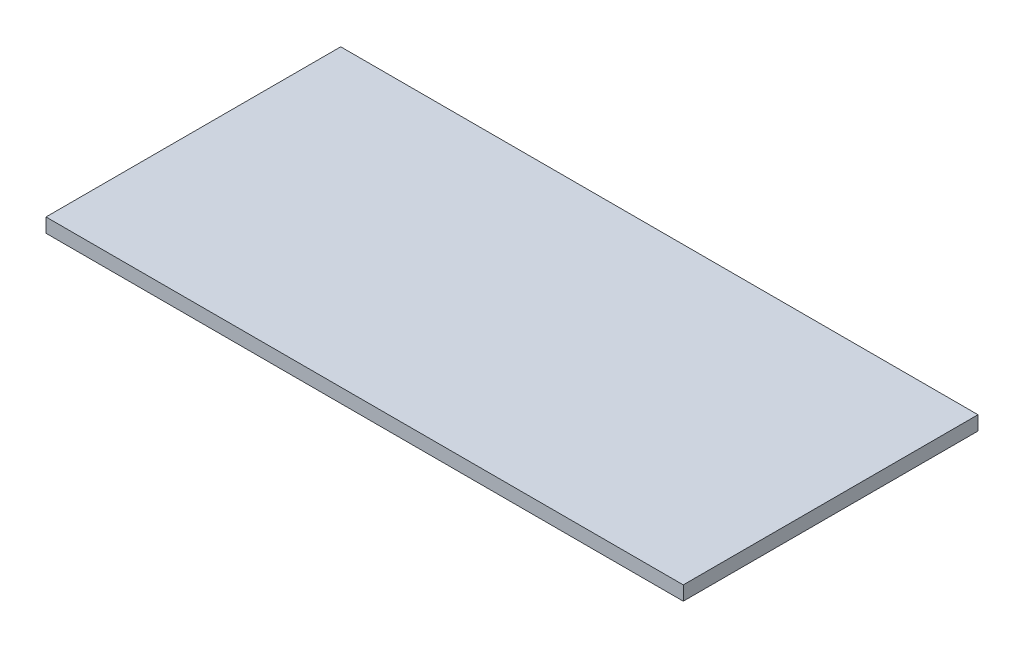
ISO-10303-21;
HEADER;
FILE_DESCRIPTION(('STEP AP214'),'2;1');
FILE_NAME('part.step','',(''),(''),'','','');
FILE_SCHEMA(('AUTOMOTIVE_DESIGN { 1 0 10303 214 1 1 1 1 }'));
ENDSEC;
DATA;
#1=APPLICATION_CONTEXT('core data for automotive mechanical design processes');
#2=APPLICATION_PROTOCOL_DEFINITION('international standard','automotive_design',2000,#1);
#3=PRODUCT_CONTEXT('',#1,'mechanical');
#4=PRODUCT('Part','Part','',(#3));
#5=PRODUCT_RELATED_PRODUCT_CATEGORY('part','',(#4));
#6=PRODUCT_DEFINITION_FORMATION('','',#4);
#7=PRODUCT_DEFINITION_CONTEXT('part definition',#1,'design');
#8=PRODUCT_DEFINITION('design','',#6,#7);
#9=PRODUCT_DEFINITION_SHAPE('','',#8);
#10=(LENGTH_UNIT() NAMED_UNIT(*) SI_UNIT(.MILLI.,.METRE.));
#11=(NAMED_UNIT(*) PLANE_ANGLE_UNIT() SI_UNIT($,.RADIAN.));
#12=(NAMED_UNIT(*) SI_UNIT($,.STERADIAN.) SOLID_ANGLE_UNIT());
#13=UNCERTAINTY_MEASURE_WITH_UNIT(LENGTH_MEASURE(1.E-05),#10,'distance_accuracy_value','');
#14=(GEOMETRIC_REPRESENTATION_CONTEXT(3) GLOBAL_UNCERTAINTY_ASSIGNED_CONTEXT((#13)) GLOBAL_UNIT_ASSIGNED_CONTEXT((#10,
#11,#12)) REPRESENTATION_CONTEXT('',''));
#15=CARTESIAN_POINT('',(0.,0.,0.));
#16=DIRECTION('',(0.,0.,1.));
#17=DIRECTION('',(1.,0.,0.));
#18=AXIS2_PLACEMENT_3D('',#15,#16,#17);
#19=CARTESIAN_POINT('',(0.,25.4,0.));
#20=DIRECTION('',(1.,0.,0.));
#21=DIRECTION('',(0.,0.,-1.));
#22=AXIS2_PLACEMENT_3D('',#19,#20,#21);
#23=PLANE('',#22);
#24=DIRECTION('',(0.,0.,1.));
#25=VECTOR('',#24,1.);
#26=CARTESIAN_POINT('',(0.,0.,0.));
#27=LINE('',#26,#25);
#28=CARTESIAN_POINT('',(0.,0.,-528.6375));
#29=VERTEX_POINT('',#28);
#30=CARTESIAN_POINT('',(0.,0.,0.));
#31=VERTEX_POINT('',#30);
#32=EDGE_CURVE('E140',#29,#31,#27,.T.);
#33=ORIENTED_EDGE('',*,*,#32,.T.);
#34=DIRECTION('',(0.,-1.,0.));
#35=VECTOR('',#34,1.);
#36=CARTESIAN_POINT('',(0.,25.4,0.));
#37=LINE('',#36,#35);
#38=CARTESIAN_POINT('',(0.,25.4,0.));
#39=VERTEX_POINT('',#38);
#40=EDGE_CURVE('E12',#39,#31,#37,.T.);
#41=ORIENTED_EDGE('',*,*,#40,.F.);
#42=DIRECTION('',(0.,0.,1.));
#43=VECTOR('',#42,1.);
#44=CARTESIAN_POINT('',(0.,25.4,0.));
#45=LINE('',#44,#43);
#46=CARTESIAN_POINT('',(0.,25.4,-528.6375));
#47=VERTEX_POINT('',#46);
#48=EDGE_CURVE('E102',#47,#39,#45,.T.);
#49=ORIENTED_EDGE('',*,*,#48,.F.);
#50=DIRECTION('',(0.,-1.,0.));
#51=VECTOR('',#50,1.);
#52=CARTESIAN_POINT('',(0.,25.4,-528.6375));
#53=LINE('',#52,#51);
#54=EDGE_CURVE('E114',#47,#29,#53,.T.);
#55=ORIENTED_EDGE('',*,*,#54,.T.);
#56=EDGE_LOOP('',(#33,#41,#49,#55));
#57=FACE_BOUND('',#56,.T.);
#58=ADVANCED_FACE('F49',(#57),#23,.F.);
#59=CARTESIAN_POINT('',(0.,25.4,0.));
#60=DIRECTION('',(0.,0.,-1.));
#61=DIRECTION('',(-1.,0.,0.));
#62=AXIS2_PLACEMENT_3D('',#59,#60,#61);
#63=PLANE('',#62);
#64=DIRECTION('',(1.,0.,0.));
#65=VECTOR('',#64,1.);
#66=CARTESIAN_POINT('',(0.,0.,0.));
#67=LINE('',#66,#65);
#68=CARTESIAN_POINT('',(1143.,0.,0.));
#69=VERTEX_POINT('',#68);
#70=EDGE_CURVE('E107',#31,#69,#67,.T.);
#71=ORIENTED_EDGE('',*,*,#70,.T.);
#72=DIRECTION('',(0.,-1.,0.));
#73=VECTOR('',#72,1.);
#74=CARTESIAN_POINT('',(1143.,25.4,0.));
#75=LINE('',#74,#73);
#76=CARTESIAN_POINT('',(1143.,25.4,0.));
#77=VERTEX_POINT('',#76);
#78=EDGE_CURVE('E59',#77,#69,#75,.T.);
#79=ORIENTED_EDGE('',*,*,#78,.F.);
#80=DIRECTION('',(1.,0.,0.));
#81=VECTOR('',#80,1.);
#82=CARTESIAN_POINT('',(0.,25.4,0.));
#83=LINE('',#82,#81);
#84=EDGE_CURVE('E97',#39,#77,#83,.T.);
#85=ORIENTED_EDGE('',*,*,#84,.F.);
#86=ORIENTED_EDGE('',*,*,#40,.T.);
#87=EDGE_LOOP('',(#71,#79,#85,#86));
#88=FACE_BOUND('',#87,.T.);
#89=ADVANCED_FACE('F106',(#88),#63,.F.);
#90=CARTESIAN_POINT('',(1143.,25.4,0.));
#91=DIRECTION('',(-1.,0.,0.));
#92=DIRECTION('',(0.,0.,1.));
#93=AXIS2_PLACEMENT_3D('',#90,#91,#92);
#94=PLANE('',#93);
#95=DIRECTION('',(0.,0.,-1.));
#96=VECTOR('',#95,1.);
#97=CARTESIAN_POINT('',(1143.,0.,0.));
#98=LINE('',#97,#96);
#99=CARTESIAN_POINT('',(1143.,0.,-528.6375));
#100=VERTEX_POINT('',#99);
#101=EDGE_CURVE('E84',#69,#100,#98,.T.);
#102=ORIENTED_EDGE('',*,*,#101,.T.);
#103=DIRECTION('',(0.,-1.,0.));
#104=VECTOR('',#103,1.);
#105=CARTESIAN_POINT('',(1143.,25.4,-528.6375));
#106=LINE('',#105,#104);
#107=CARTESIAN_POINT('',(1143.,25.4,-528.6375));
#108=VERTEX_POINT('',#107);
#109=EDGE_CURVE('E109',#108,#100,#106,.T.);
#110=ORIENTED_EDGE('',*,*,#109,.F.);
#111=DIRECTION('',(0.,0.,-1.));
#112=VECTOR('',#111,1.);
#113=CARTESIAN_POINT('',(1143.,25.4,0.));
#114=LINE('',#113,#112);
#115=EDGE_CURVE('E100',#77,#108,#114,.T.);
#116=ORIENTED_EDGE('',*,*,#115,.F.);
#117=ORIENTED_EDGE('',*,*,#78,.T.);
#118=EDGE_LOOP('',(#102,#110,#116,#117));
#119=FACE_BOUND('',#118,.T.);
#120=ADVANCED_FACE('F110',(#119),#94,.F.);
#121=CARTESIAN_POINT('',(0.,25.4,-528.6375));
#122=DIRECTION('',(0.,0.,1.));
#123=DIRECTION('',(1.,0.,0.));
#124=AXIS2_PLACEMENT_3D('',#121,#122,#123);
#125=PLANE('',#124);
#126=DIRECTION('',(-1.,0.,0.));
#127=VECTOR('',#126,1.);
#128=CARTESIAN_POINT('',(0.,0.,-528.6375));
#129=LINE('',#128,#127);
#130=EDGE_CURVE('E90',#100,#29,#129,.T.);
#131=ORIENTED_EDGE('',*,*,#130,.T.);
#132=ORIENTED_EDGE('',*,*,#54,.F.);
#133=DIRECTION('',(-1.,0.,0.));
#134=VECTOR('',#133,1.);
#135=CARTESIAN_POINT('',(0.,25.4,-528.6375));
#136=LINE('',#135,#134);
#137=EDGE_CURVE('E67',#108,#47,#136,.T.);
#138=ORIENTED_EDGE('',*,*,#137,.F.);
#139=ORIENTED_EDGE('',*,*,#109,.T.);
#140=EDGE_LOOP('',(#131,#132,#138,#139));
#141=FACE_BOUND('',#140,.T.);
#142=ADVANCED_FACE('F135',(#141),#125,.F.);
#143=CARTESIAN_POINT('',(0.,25.4,0.));
#144=DIRECTION('',(0.,-1.,0.));
#145=DIRECTION('',(0.,0.,-1.));
#146=AXIS2_PLACEMENT_3D('',#143,#144,#145);
#147=PLANE('',#146);
#148=ORIENTED_EDGE('',*,*,#48,.T.);
#149=ORIENTED_EDGE('',*,*,#84,.T.);
#150=ORIENTED_EDGE('',*,*,#115,.T.);
#151=ORIENTED_EDGE('',*,*,#137,.T.);
#152=EDGE_LOOP('',(#148,#149,#150,#151));
#153=FACE_BOUND('',#152,.T.);
#154=ADVANCED_FACE('F98',(#153),#147,.F.);
#155=CARTESIAN_POINT('',(0.,0.,0.));
#156=DIRECTION('',(0.,-1.,0.));
#157=DIRECTION('',(0.,0.,-1.));
#158=AXIS2_PLACEMENT_3D('',#155,#156,#157);
#159=PLANE('',#158);
#160=ORIENTED_EDGE('',*,*,#32,.F.);
#161=ORIENTED_EDGE('',*,*,#130,.F.);
#162=ORIENTED_EDGE('',*,*,#101,.F.);
#163=ORIENTED_EDGE('',*,*,#70,.F.);
#164=EDGE_LOOP('',(#160,#161,#162,#163));
#165=FACE_BOUND('',#164,.T.);
#166=ADVANCED_FACE('F138',(#165),#159,.T.);
#167=CLOSED_SHELL('',(#58,#89,#120,#142,#154,#166));
#168=MANIFOLD_SOLID_BREP('B2',#167);
#169=ADVANCED_BREP_SHAPE_REPRESENTATION('',(#18,#168),#14);
#170=SHAPE_DEFINITION_REPRESENTATION(#9,#169);
ENDSEC;
END-ISO-10303-21;
